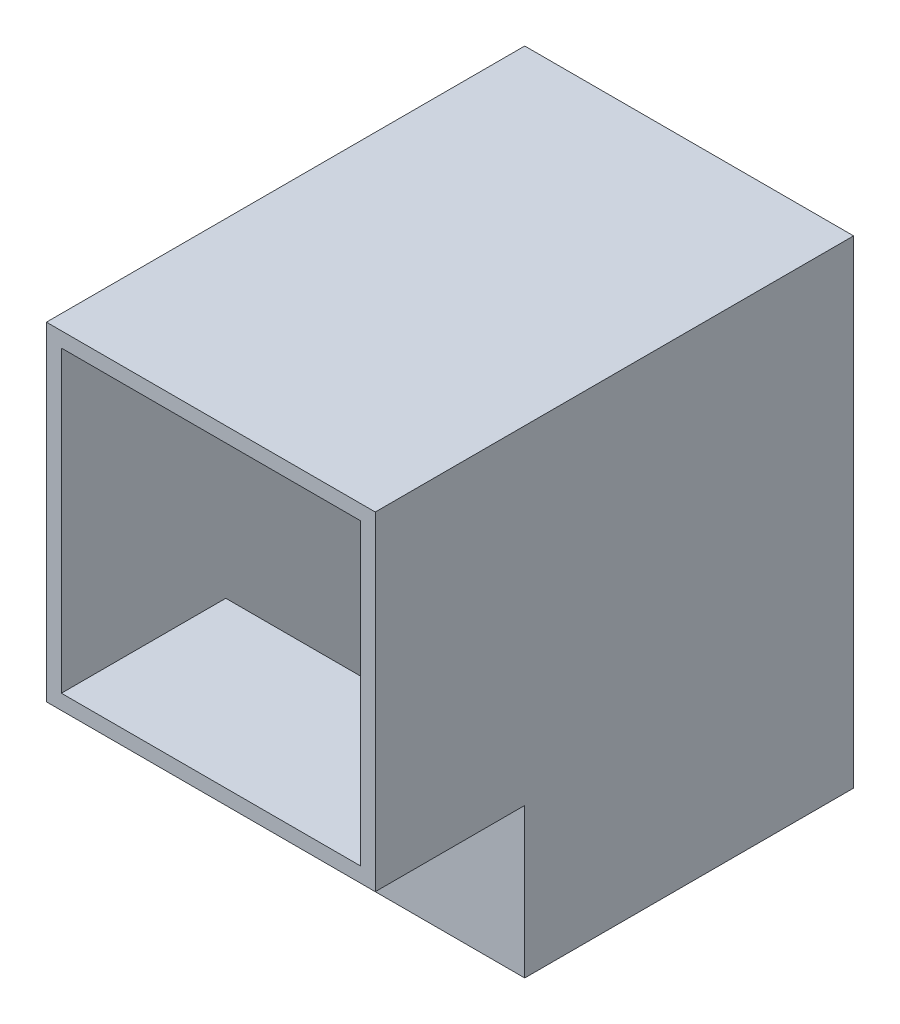
ISO-10303-21;
HEADER;
FILE_DESCRIPTION(('STEP AP214'),'2;1');
FILE_NAME('part.step','',(''),(''),'','','');
FILE_SCHEMA(('AUTOMOTIVE_DESIGN { 1 0 10303 214 1 1 1 1 }'));
ENDSEC;
DATA;
#1=APPLICATION_CONTEXT('core data for automotive mechanical design processes');
#2=APPLICATION_PROTOCOL_DEFINITION('international standard','automotive_design',2000,#1);
#3=PRODUCT_CONTEXT('',#1,'mechanical');
#4=PRODUCT('Part','Part','',(#3));
#5=PRODUCT_RELATED_PRODUCT_CATEGORY('part','',(#4));
#6=PRODUCT_DEFINITION_FORMATION('','',#4);
#7=PRODUCT_DEFINITION_CONTEXT('part definition',#1,'design');
#8=PRODUCT_DEFINITION('design','',#6,#7);
#9=PRODUCT_DEFINITION_SHAPE('','',#8);
#10=(LENGTH_UNIT() NAMED_UNIT(*) SI_UNIT(.MILLI.,.METRE.));
#11=(NAMED_UNIT(*) PLANE_ANGLE_UNIT() SI_UNIT($,.RADIAN.));
#12=(NAMED_UNIT(*) SI_UNIT($,.STERADIAN.) SOLID_ANGLE_UNIT());
#13=UNCERTAINTY_MEASURE_WITH_UNIT(LENGTH_MEASURE(1.E-05),#10,'distance_accuracy_value','');
#14=(GEOMETRIC_REPRESENTATION_CONTEXT(3) GLOBAL_UNCERTAINTY_ASSIGNED_CONTEXT((#13)) GLOBAL_UNIT_ASSIGNED_CONTEXT((#10,
#11,#12)) REPRESENTATION_CONTEXT('',''));
#15=CARTESIAN_POINT('',(0.,0.,0.));
#16=DIRECTION('',(0.,0.,1.));
#17=DIRECTION('',(1.,0.,0.));
#18=AXIS2_PLACEMENT_3D('',#15,#16,#17);
#19=CARTESIAN_POINT('',(-2.,-2.,64.));
#20=DIRECTION('',(0.,1.,0.));
#21=DIRECTION('',(0.,0.,1.));
#22=AXIS2_PLACEMENT_3D('',#19,#20,#21);
#23=PLANE('',#22);
#24=DIRECTION('',(-1.,0.,0.));
#25=VECTOR('',#24,1.);
#26=CARTESIAN_POINT('',(-2.,-2.,44.));
#27=LINE('',#26,#25);
#28=CARTESIAN_POINT('',(42.,-2.,44.));
#29=VERTEX_POINT('',#28);
#30=CARTESIAN_POINT('',(-2.,-2.,44.));
#31=VERTEX_POINT('',#30);
#32=EDGE_CURVE('E172',#29,#31,#27,.T.);
#33=ORIENTED_EDGE('',*,*,#32,.F.);
#34=DIRECTION('',(0.,0.,-1.));
#35=VECTOR('',#34,1.);
#36=CARTESIAN_POINT('',(42.,-2.,64.));
#37=LINE('',#36,#35);
#38=CARTESIAN_POINT('',(42.,-2.,64.));
#39=VERTEX_POINT('',#38);
#40=EDGE_CURVE('E25',#39,#29,#37,.T.);
#41=ORIENTED_EDGE('',*,*,#40,.F.);
#42=DIRECTION('',(1.,0.,0.));
#43=VECTOR('',#42,1.);
#44=CARTESIAN_POINT('',(-2.,-2.,64.));
#45=LINE('',#44,#43);
#46=CARTESIAN_POINT('',(-2.,-2.,64.));
#47=VERTEX_POINT('',#46);
#48=EDGE_CURVE('E142',#47,#39,#45,.T.);
#49=ORIENTED_EDGE('',*,*,#48,.F.);
#50=DIRECTION('',(0.,0.,-1.));
#51=VECTOR('',#50,1.);
#52=CARTESIAN_POINT('',(-2.,-2.,64.));
#53=LINE('',#52,#51);
#54=EDGE_CURVE('E11',#47,#31,#53,.T.);
#55=ORIENTED_EDGE('',*,*,#54,.T.);
#56=EDGE_LOOP('',(#33,#41,#49,#55));
#57=FACE_BOUND('',#56,.T.);
#58=ADVANCED_FACE('F17',(#57),#23,.F.);
#59=CARTESIAN_POINT('',(0.,0.,64.));
#60=DIRECTION('',(0.,0.,-1.));
#61=DIRECTION('',(-1.,0.,0.));
#62=AXIS2_PLACEMENT_3D('',#59,#60,#61);
#63=PLANE('',#62);
#64=DIRECTION('',(0.,-1.,0.));
#65=VECTOR('',#64,1.);
#66=CARTESIAN_POINT('',(-2.,-2.,64.));
#67=LINE('',#66,#65);
#68=CARTESIAN_POINT('',(-2.,42.,64.));
#69=VERTEX_POINT('',#68);
#70=EDGE_CURVE('E139',#69,#47,#67,.T.);
#71=ORIENTED_EDGE('',*,*,#70,.T.);
#72=ORIENTED_EDGE('',*,*,#48,.T.);
#73=DIRECTION('',(0.,1.,0.));
#74=VECTOR('',#73,1.);
#75=CARTESIAN_POINT('',(42.,-2.,64.));
#76=LINE('',#75,#74);
#77=CARTESIAN_POINT('',(42.,42.,64.));
#78=VERTEX_POINT('',#77);
#79=EDGE_CURVE('E145',#39,#78,#76,.T.);
#80=ORIENTED_EDGE('',*,*,#79,.T.);
#81=DIRECTION('',(-1.,0.,0.));
#82=VECTOR('',#81,1.);
#83=CARTESIAN_POINT('',(-2.,42.,64.));
#84=LINE('',#83,#82);
#85=EDGE_CURVE('E147',#78,#69,#84,.T.);
#86=ORIENTED_EDGE('',*,*,#85,.T.);
#87=EDGE_LOOP('',(#71,#72,#80,#86));
#88=FACE_BOUND('',#87,.T.);
#89=DIRECTION('',(0.,-1.,0.));
#90=VECTOR('',#89,1.);
#91=CARTESIAN_POINT('',(0.,0.,64.));
#92=LINE('',#91,#90);
#93=CARTESIAN_POINT('',(0.,40.,64.));
#94=VERTEX_POINT('',#93);
#95=CARTESIAN_POINT('',(0.,0.,64.));
#96=VERTEX_POINT('',#95);
#97=EDGE_CURVE('E130',#94,#96,#92,.T.);
#98=ORIENTED_EDGE('',*,*,#97,.F.);
#99=DIRECTION('',(-1.,0.,0.));
#100=VECTOR('',#99,1.);
#101=CARTESIAN_POINT('',(0.,40.,64.));
#102=LINE('',#101,#100);
#103=CARTESIAN_POINT('',(40.,40.,64.));
#104=VERTEX_POINT('',#103);
#105=EDGE_CURVE('E186',#104,#94,#102,.T.);
#106=ORIENTED_EDGE('',*,*,#105,.F.);
#107=DIRECTION('',(0.,1.,0.));
#108=VECTOR('',#107,1.);
#109=CARTESIAN_POINT('',(40.,0.,64.));
#110=LINE('',#109,#108);
#111=CARTESIAN_POINT('',(40.,0.,64.));
#112=VERTEX_POINT('',#111);
#113=EDGE_CURVE('E183',#112,#104,#110,.T.);
#114=ORIENTED_EDGE('',*,*,#113,.F.);
#115=DIRECTION('',(1.,0.,0.));
#116=VECTOR('',#115,1.);
#117=CARTESIAN_POINT('',(0.,0.,64.));
#118=LINE('',#117,#116);
#119=EDGE_CURVE('E177',#96,#112,#118,.T.);
#120=ORIENTED_EDGE('',*,*,#119,.F.);
#121=EDGE_LOOP('',(#98,#106,#114,#120));
#122=FACE_BOUND('',#121,.T.);
#123=ADVANCED_FACE('F234',(#88,#122),#63,.F.);
#124=CARTESIAN_POINT('',(0.,0.,0.));
#125=DIRECTION('',(0.,0.,-1.));
#126=DIRECTION('',(-1.,0.,0.));
#127=AXIS2_PLACEMENT_3D('',#124,#125,#126);
#128=PLANE('',#127);
#129=DIRECTION('',(0.,-1.,0.));
#130=VECTOR('',#129,1.);
#131=CARTESIAN_POINT('',(-2.,-2.,0.));
#132=LINE('',#131,#130);
#133=CARTESIAN_POINT('',(-2.,42.,0.));
#134=VERTEX_POINT('',#133);
#135=CARTESIAN_POINT('',(-2.,-22.,0.));
#136=VERTEX_POINT('',#135);
#137=EDGE_CURVE('E131',#134,#136,#132,.T.);
#138=ORIENTED_EDGE('',*,*,#137,.F.);
#139=DIRECTION('',(-1.,0.,0.));
#140=VECTOR('',#139,1.);
#141=CARTESIAN_POINT('',(-2.,42.,0.));
#142=LINE('',#141,#140);
#143=CARTESIAN_POINT('',(42.,42.,0.));
#144=VERTEX_POINT('',#143);
#145=EDGE_CURVE('E143',#144,#134,#142,.T.);
#146=ORIENTED_EDGE('',*,*,#145,.F.);
#147=DIRECTION('',(0.,1.,0.));
#148=VECTOR('',#147,1.);
#149=CARTESIAN_POINT('',(42.,-2.,0.));
#150=LINE('',#149,#148);
#151=CARTESIAN_POINT('',(42.,-22.,0.));
#152=VERTEX_POINT('',#151);
#153=EDGE_CURVE('E133',#152,#144,#150,.T.);
#154=ORIENTED_EDGE('',*,*,#153,.F.);
#155=DIRECTION('',(1.,0.,0.));
#156=VECTOR('',#155,1.);
#157=CARTESIAN_POINT('',(-2.,-22.,0.));
#158=LINE('',#157,#156);
#159=EDGE_CURVE('E212',#136,#152,#158,.T.);
#160=ORIENTED_EDGE('',*,*,#159,.F.);
#161=EDGE_LOOP('',(#138,#146,#154,#160));
#162=FACE_BOUND('',#161,.T.);
#163=ADVANCED_FACE('F229',(#162),#128,.T.);
#164=CARTESIAN_POINT('',(-2.,-2.,64.));
#165=DIRECTION('',(1.,0.,0.));
#166=DIRECTION('',(0.,0.,-1.));
#167=AXIS2_PLACEMENT_3D('',#164,#165,#166);
#168=PLANE('',#167);
#169=ORIENTED_EDGE('',*,*,#137,.T.);
#170=DIRECTION('',(0.,0.,-1.));
#171=VECTOR('',#170,1.);
#172=CARTESIAN_POINT('',(-2.,-22.,0.));
#173=LINE('',#172,#171);
#174=CARTESIAN_POINT('',(-2.,-22.,44.));
#175=VERTEX_POINT('',#174);
#176=EDGE_CURVE('E209',#175,#136,#173,.T.);
#177=ORIENTED_EDGE('',*,*,#176,.F.);
#178=DIRECTION('',(0.,1.,0.));
#179=VECTOR('',#178,1.);
#180=CARTESIAN_POINT('',(-2.,-22.,44.));
#181=LINE('',#180,#179);
#182=EDGE_CURVE('E175',#175,#31,#181,.T.);
#183=ORIENTED_EDGE('',*,*,#182,.T.);
#184=ORIENTED_EDGE('',*,*,#54,.F.);
#185=ORIENTED_EDGE('',*,*,#70,.F.);
#186=DIRECTION('',(0.,0.,-1.));
#187=VECTOR('',#186,1.);
#188=CARTESIAN_POINT('',(-2.,42.,64.));
#189=LINE('',#188,#187);
#190=EDGE_CURVE('E148',#69,#134,#189,.T.);
#191=ORIENTED_EDGE('',*,*,#190,.T.);
#192=EDGE_LOOP('',(#169,#177,#183,#184,#185,#191));
#193=FACE_BOUND('',#192,.T.);
#194=ADVANCED_FACE('F19',(#193),#168,.F.);
#195=CARTESIAN_POINT('',(42.,-2.,64.));
#196=DIRECTION('',(-1.,0.,0.));
#197=DIRECTION('',(0.,0.,1.));
#198=AXIS2_PLACEMENT_3D('',#195,#196,#197);
#199=PLANE('',#198);
#200=ORIENTED_EDGE('',*,*,#153,.T.);
#201=DIRECTION('',(0.,0.,-1.));
#202=VECTOR('',#201,1.);
#203=CARTESIAN_POINT('',(42.,42.,64.));
#204=LINE('',#203,#202);
#205=EDGE_CURVE('E154',#78,#144,#204,.T.);
#206=ORIENTED_EDGE('',*,*,#205,.F.);
#207=ORIENTED_EDGE('',*,*,#79,.F.);
#208=ORIENTED_EDGE('',*,*,#40,.T.);
#209=DIRECTION('',(0.,1.,0.));
#210=VECTOR('',#209,1.);
#211=CARTESIAN_POINT('',(42.,-22.,44.));
#212=LINE('',#211,#210);
#213=CARTESIAN_POINT('',(42.,-22.,44.));
#214=VERTEX_POINT('',#213);
#215=EDGE_CURVE('E164',#214,#29,#212,.T.);
#216=ORIENTED_EDGE('',*,*,#215,.F.);
#217=DIRECTION('',(0.,0.,1.));
#218=VECTOR('',#217,1.);
#219=CARTESIAN_POINT('',(42.,-22.,0.));
#220=LINE('',#219,#218);
#221=EDGE_CURVE('E215',#152,#214,#220,.T.);
#222=ORIENTED_EDGE('',*,*,#221,.F.);
#223=EDGE_LOOP('',(#200,#206,#207,#208,#216,#222));
#224=FACE_BOUND('',#223,.T.);
#225=ADVANCED_FACE('F162',(#224),#199,.F.);
#226=CARTESIAN_POINT('',(-2.,42.,64.));
#227=DIRECTION('',(0.,-1.,0.));
#228=DIRECTION('',(0.,0.,-1.));
#229=AXIS2_PLACEMENT_3D('',#226,#227,#228);
#230=PLANE('',#229);
#231=ORIENTED_EDGE('',*,*,#145,.T.);
#232=ORIENTED_EDGE('',*,*,#190,.F.);
#233=ORIENTED_EDGE('',*,*,#85,.F.);
#234=ORIENTED_EDGE('',*,*,#205,.T.);
#235=EDGE_LOOP('',(#231,#232,#233,#234));
#236=FACE_BOUND('',#235,.T.);
#237=ADVANCED_FACE('F232',(#236),#230,.F.);
#238=CARTESIAN_POINT('',(0.,0.,64.));
#239=DIRECTION('',(1.,0.,0.));
#240=DIRECTION('',(0.,0.,-1.));
#241=AXIS2_PLACEMENT_3D('',#238,#239,#240);
#242=PLANE('',#241);
#243=DIRECTION('',(0.,1.,0.));
#244=VECTOR('',#243,1.);
#245=CARTESIAN_POINT('',(0.,-22.,2.));
#246=LINE('',#245,#244);
#247=CARTESIAN_POINT('',(0.,-22.,2.));
#248=VERTEX_POINT('',#247);
#249=CARTESIAN_POINT('',(0.,40.,2.));
#250=VERTEX_POINT('',#249);
#251=EDGE_CURVE('E32',#248,#250,#246,.T.);
#252=ORIENTED_EDGE('',*,*,#251,.T.);
#253=DIRECTION('',(0.,0.,-1.));
#254=VECTOR('',#253,1.);
#255=CARTESIAN_POINT('',(0.,40.,64.));
#256=LINE('',#255,#254);
#257=EDGE_CURVE('E188',#94,#250,#256,.T.);
#258=ORIENTED_EDGE('',*,*,#257,.F.);
#259=ORIENTED_EDGE('',*,*,#97,.T.);
#260=DIRECTION('',(0.,0.,-1.));
#261=VECTOR('',#260,1.);
#262=CARTESIAN_POINT('',(0.,0.,64.));
#263=LINE('',#262,#261);
#264=CARTESIAN_POINT('',(0.,0.,42.));
#265=VERTEX_POINT('',#264);
#266=EDGE_CURVE('E121',#96,#265,#263,.T.);
#267=ORIENTED_EDGE('',*,*,#266,.T.);
#268=DIRECTION('',(0.,1.,0.));
#269=VECTOR('',#268,1.);
#270=CARTESIAN_POINT('',(0.,-22.,42.));
#271=LINE('',#270,#269);
#272=CARTESIAN_POINT('',(0.,-22.,42.));
#273=VERTEX_POINT('',#272);
#274=EDGE_CURVE('E107',#273,#265,#271,.T.);
#275=ORIENTED_EDGE('',*,*,#274,.F.);
#276=DIRECTION('',(0.,0.,-1.));
#277=VECTOR('',#276,1.);
#278=CARTESIAN_POINT('',(0.,-22.,2.));
#279=LINE('',#278,#277);
#280=EDGE_CURVE('E125',#273,#248,#279,.T.);
#281=ORIENTED_EDGE('',*,*,#280,.T.);
#282=EDGE_LOOP('',(#252,#258,#259,#267,#275,#281));
#283=FACE_BOUND('',#282,.T.);
#284=ADVANCED_FACE('F128',(#283),#242,.T.);
#285=CARTESIAN_POINT('',(0.,0.,64.));
#286=DIRECTION('',(0.,1.,0.));
#287=DIRECTION('',(0.,0.,1.));
#288=AXIS2_PLACEMENT_3D('',#285,#286,#287);
#289=PLANE('',#288);
#290=DIRECTION('',(-1.,0.,0.));
#291=VECTOR('',#290,1.);
#292=CARTESIAN_POINT('',(40.,0.,42.));
#293=LINE('',#292,#291);
#294=CARTESIAN_POINT('',(40.,0.,42.));
#295=VERTEX_POINT('',#294);
#296=EDGE_CURVE('E110',#295,#265,#293,.T.);
#297=ORIENTED_EDGE('',*,*,#296,.T.);
#298=ORIENTED_EDGE('',*,*,#266,.F.);
#299=ORIENTED_EDGE('',*,*,#119,.T.);
#300=DIRECTION('',(0.,0.,-1.));
#301=VECTOR('',#300,1.);
#302=CARTESIAN_POINT('',(40.,0.,64.));
#303=LINE('',#302,#301);
#304=EDGE_CURVE('E124',#112,#295,#303,.T.);
#305=ORIENTED_EDGE('',*,*,#304,.T.);
#306=EDGE_LOOP('',(#297,#298,#299,#305));
#307=FACE_BOUND('',#306,.T.);
#308=ADVANCED_FACE('F120',(#307),#289,.T.);
#309=CARTESIAN_POINT('',(40.,0.,64.));
#310=DIRECTION('',(-1.,0.,0.));
#311=DIRECTION('',(0.,0.,1.));
#312=AXIS2_PLACEMENT_3D('',#309,#310,#311);
#313=PLANE('',#312);
#314=DIRECTION('',(0.,0.,-1.));
#315=VECTOR('',#314,1.);
#316=CARTESIAN_POINT('',(40.,40.,64.));
#317=LINE('',#316,#315);
#318=CARTESIAN_POINT('',(40.,40.,2.));
#319=VERTEX_POINT('',#318);
#320=EDGE_CURVE('E135',#104,#319,#317,.T.);
#321=ORIENTED_EDGE('',*,*,#320,.T.);
#322=DIRECTION('',(0.,1.,0.));
#323=VECTOR('',#322,1.);
#324=CARTESIAN_POINT('',(40.,-22.,2.));
#325=LINE('',#324,#323);
#326=CARTESIAN_POINT('',(40.,-22.,2.));
#327=VERTEX_POINT('',#326);
#328=EDGE_CURVE('E40',#327,#319,#325,.T.);
#329=ORIENTED_EDGE('',*,*,#328,.F.);
#330=DIRECTION('',(0.,0.,1.));
#331=VECTOR('',#330,1.);
#332=CARTESIAN_POINT('',(40.,-22.,2.));
#333=LINE('',#332,#331);
#334=CARTESIAN_POINT('',(40.,-22.,42.));
#335=VERTEX_POINT('',#334);
#336=EDGE_CURVE('E203',#327,#335,#333,.T.);
#337=ORIENTED_EDGE('',*,*,#336,.T.);
#338=DIRECTION('',(0.,1.,0.));
#339=VECTOR('',#338,1.);
#340=CARTESIAN_POINT('',(40.,-22.,42.));
#341=LINE('',#340,#339);
#342=EDGE_CURVE('E116',#335,#295,#341,.T.);
#343=ORIENTED_EDGE('',*,*,#342,.T.);
#344=ORIENTED_EDGE('',*,*,#304,.F.);
#345=ORIENTED_EDGE('',*,*,#113,.T.);
#346=EDGE_LOOP('',(#321,#329,#337,#343,#344,#345));
#347=FACE_BOUND('',#346,.T.);
#348=ADVANCED_FACE('F191',(#347),#313,.T.);
#349=CARTESIAN_POINT('',(0.,40.,64.));
#350=DIRECTION('',(0.,-1.,0.));
#351=DIRECTION('',(0.,0.,-1.));
#352=AXIS2_PLACEMENT_3D('',#349,#350,#351);
#353=PLANE('',#352);
#354=DIRECTION('',(1.,0.,0.));
#355=VECTOR('',#354,1.);
#356=CARTESIAN_POINT('',(40.,40.,2.));
#357=LINE('',#356,#355);
#358=EDGE_CURVE('E126',#250,#319,#357,.T.);
#359=ORIENTED_EDGE('',*,*,#358,.T.);
#360=ORIENTED_EDGE('',*,*,#320,.F.);
#361=ORIENTED_EDGE('',*,*,#105,.T.);
#362=ORIENTED_EDGE('',*,*,#257,.T.);
#363=EDGE_LOOP('',(#359,#360,#361,#362));
#364=FACE_BOUND('',#363,.T.);
#365=ADVANCED_FACE('F197',(#364),#353,.T.);
#366=CARTESIAN_POINT('',(0.,-22.,0.));
#367=DIRECTION('',(0.,1.,0.));
#368=DIRECTION('',(0.,0.,1.));
#369=AXIS2_PLACEMENT_3D('',#366,#367,#368);
#370=PLANE('',#369);
#371=ORIENTED_EDGE('',*,*,#176,.T.);
#372=ORIENTED_EDGE('',*,*,#159,.T.);
#373=ORIENTED_EDGE('',*,*,#221,.T.);
#374=DIRECTION('',(-1.,0.,0.));
#375=VECTOR('',#374,1.);
#376=CARTESIAN_POINT('',(-2.,-22.,44.));
#377=LINE('',#376,#375);
#378=EDGE_CURVE('E174',#214,#175,#377,.T.);
#379=ORIENTED_EDGE('',*,*,#378,.T.);
#380=EDGE_LOOP('',(#371,#372,#373,#379));
#381=FACE_BOUND('',#380,.T.);
#382=ORIENTED_EDGE('',*,*,#280,.F.);
#383=DIRECTION('',(-1.,0.,0.));
#384=VECTOR('',#383,1.);
#385=CARTESIAN_POINT('',(0.,-22.,42.));
#386=LINE('',#385,#384);
#387=EDGE_CURVE('E113',#335,#273,#386,.T.);
#388=ORIENTED_EDGE('',*,*,#387,.F.);
#389=ORIENTED_EDGE('',*,*,#336,.F.);
#390=DIRECTION('',(1.,0.,0.));
#391=VECTOR('',#390,1.);
#392=CARTESIAN_POINT('',(0.,-22.,2.));
#393=LINE('',#392,#391);
#394=EDGE_CURVE('E201',#248,#327,#393,.T.);
#395=ORIENTED_EDGE('',*,*,#394,.F.);
#396=EDGE_LOOP('',(#382,#388,#389,#395));
#397=FACE_BOUND('',#396,.T.);
#398=ADVANCED_FACE('F218',(#381,#397),#370,.F.);
#399=CARTESIAN_POINT('',(-2.,-22.,44.));
#400=DIRECTION('',(0.,0.,-1.));
#401=DIRECTION('',(-1.,0.,0.));
#402=AXIS2_PLACEMENT_3D('',#399,#400,#401);
#403=PLANE('',#402);
#404=ORIENTED_EDGE('',*,*,#32,.T.);
#405=ORIENTED_EDGE('',*,*,#182,.F.);
#406=ORIENTED_EDGE('',*,*,#378,.F.);
#407=ORIENTED_EDGE('',*,*,#215,.T.);
#408=EDGE_LOOP('',(#404,#405,#406,#407));
#409=FACE_BOUND('',#408,.T.);
#410=ADVANCED_FACE('F170',(#409),#403,.F.);
#411=CARTESIAN_POINT('',(0.,-22.,2.));
#412=DIRECTION('',(0.,0.,1.));
#413=DIRECTION('',(1.,0.,0.));
#414=AXIS2_PLACEMENT_3D('',#411,#412,#413);
#415=PLANE('',#414);
#416=ORIENTED_EDGE('',*,*,#328,.T.);
#417=ORIENTED_EDGE('',*,*,#358,.F.);
#418=ORIENTED_EDGE('',*,*,#251,.F.);
#419=ORIENTED_EDGE('',*,*,#394,.T.);
#420=EDGE_LOOP('',(#416,#417,#418,#419));
#421=FACE_BOUND('',#420,.T.);
#422=ADVANCED_FACE('F260',(#421),#415,.T.);
#423=CARTESIAN_POINT('',(0.,-22.,42.));
#424=DIRECTION('',(0.,0.,-1.));
#425=DIRECTION('',(-1.,0.,0.));
#426=AXIS2_PLACEMENT_3D('',#423,#424,#425);
#427=PLANE('',#426);
#428=ORIENTED_EDGE('',*,*,#274,.T.);
#429=ORIENTED_EDGE('',*,*,#296,.F.);
#430=ORIENTED_EDGE('',*,*,#342,.F.);
#431=ORIENTED_EDGE('',*,*,#387,.T.);
#432=EDGE_LOOP('',(#428,#429,#430,#431));
#433=FACE_BOUND('',#432,.T.);
#434=ADVANCED_FACE('F109',(#433),#427,.T.);
#435=CLOSED_SHELL('',(#58,#123,#163,#194,#225,#237,#284,#308,#348,#365,#398,#410,#422,#434));
#436=MANIFOLD_SOLID_BREP('B1',#435);
#437=ADVANCED_BREP_SHAPE_REPRESENTATION('',(#18,#436),#14);
#438=SHAPE_DEFINITION_REPRESENTATION(#9,#437);
ENDSEC;
END-ISO-10303-21;
